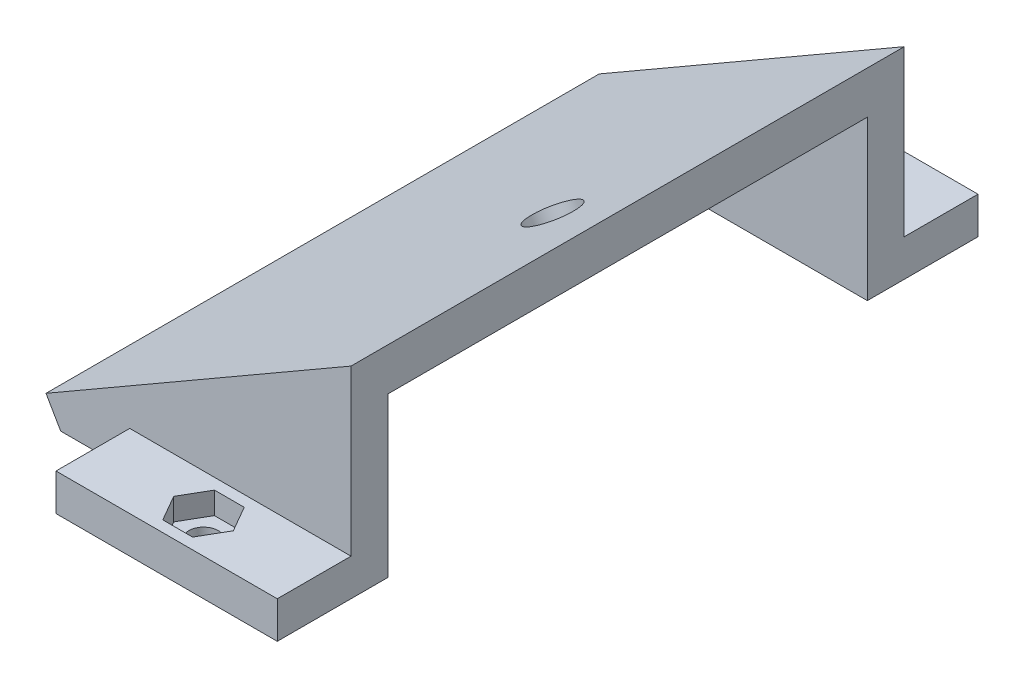
ISO-10303-21;
HEADER;
FILE_DESCRIPTION(('STEP AP214'),'2;1');
FILE_NAME('part.step','',(''),(''),'','','');
FILE_SCHEMA(('AUTOMOTIVE_DESIGN { 1 0 10303 214 1 1 1 1 }'));
ENDSEC;
DATA;
#1=APPLICATION_CONTEXT('core data for automotive mechanical design processes');
#2=APPLICATION_PROTOCOL_DEFINITION('international standard','automotive_design',2000,#1);
#3=PRODUCT_CONTEXT('',#1,'mechanical');
#4=PRODUCT('Part','Part','',(#3));
#5=PRODUCT_RELATED_PRODUCT_CATEGORY('part','',(#4));
#6=PRODUCT_DEFINITION_FORMATION('','',#4);
#7=PRODUCT_DEFINITION_CONTEXT('part definition',#1,'design');
#8=PRODUCT_DEFINITION('design','',#6,#7);
#9=PRODUCT_DEFINITION_SHAPE('','',#8);
#10=(LENGTH_UNIT() NAMED_UNIT(*) SI_UNIT(.MILLI.,.METRE.));
#11=(NAMED_UNIT(*) PLANE_ANGLE_UNIT() SI_UNIT($,.RADIAN.));
#12=(NAMED_UNIT(*) SI_UNIT($,.STERADIAN.) SOLID_ANGLE_UNIT());
#13=UNCERTAINTY_MEASURE_WITH_UNIT(LENGTH_MEASURE(1.E-05),#10,'distance_accuracy_value','');
#14=(GEOMETRIC_REPRESENTATION_CONTEXT(3) GLOBAL_UNCERTAINTY_ASSIGNED_CONTEXT((#13)) GLOBAL_UNIT_ASSIGNED_CONTEXT((#10,
#11,#12)) REPRESENTATION_CONTEXT('',''));
#15=CARTESIAN_POINT('',(0.,0.,0.));
#16=DIRECTION('',(0.,0.,1.));
#17=DIRECTION('',(1.,0.,0.));
#18=AXIS2_PLACEMENT_3D('',#15,#16,#17);
#19=CARTESIAN_POINT('',(0.,5.,85.));
#20=DIRECTION('',(0.,-1.,0.));
#21=DIRECTION('',(0.,0.,-1.));
#22=AXIS2_PLACEMENT_3D('',#19,#20,#21);
#23=PLANE('',#22);
#24=DIRECTION('',(-1.,0.,0.));
#25=VECTOR('',#24,1.);
#26=CARTESIAN_POINT('',(0.,5.,75.));
#27=LINE('',#26,#25);
#28=CARTESIAN_POINT('',(30.,5.,75.));
#29=VERTEX_POINT('',#28);
#30=CARTESIAN_POINT('',(0.,5.,75.));
#31=VERTEX_POINT('',#30);
#32=EDGE_CURVE('E354',#29,#31,#27,.T.);
#33=ORIENTED_EDGE('',*,*,#32,.T.);
#34=DIRECTION('',(0.,0.,-1.));
#35=VECTOR('',#34,1.);
#36=CARTESIAN_POINT('',(0.,5.,85.));
#37=LINE('',#36,#35);
#38=CARTESIAN_POINT('',(0.,5.,85.));
#39=VERTEX_POINT('',#38);
#40=EDGE_CURVE('E365',#39,#31,#37,.T.);
#41=ORIENTED_EDGE('',*,*,#40,.F.);
#42=DIRECTION('',(-1.,0.,0.));
#43=VECTOR('',#42,1.);
#44=CARTESIAN_POINT('',(0.,5.,85.));
#45=LINE('',#44,#43);
#46=CARTESIAN_POINT('',(30.,5.,85.));
#47=VERTEX_POINT('',#46);
#48=EDGE_CURVE('E363',#47,#39,#45,.T.);
#49=ORIENTED_EDGE('',*,*,#48,.F.);
#50=DIRECTION('',(0.,0.,-1.));
#51=VECTOR('',#50,1.);
#52=CARTESIAN_POINT('',(30.,5.,85.));
#53=LINE('',#52,#51);
#54=EDGE_CURVE('E370',#47,#29,#53,.T.);
#55=ORIENTED_EDGE('',*,*,#54,.T.);
#56=EDGE_LOOP('',(#33,#41,#49,#55));
#57=FACE_BOUND('',#56,.T.);
#58=DIRECTION('',(-0.499999999999999,0.,0.866025403784439));
#59=VECTOR('',#58,1.);
#60=CARTESIAN_POINT('',(19.0414518843274,5.,80.));
#61=LINE('',#60,#59);
#62=CARTESIAN_POINT('',(19.0414518843274,5.,80.));
#63=VERTEX_POINT('',#62);
#64=CARTESIAN_POINT('',(17.0207259421637,5.,83.5));
#65=VERTEX_POINT('',#64);
#66=EDGE_CURVE('E54',#63,#65,#61,.T.);
#67=ORIENTED_EDGE('',*,*,#66,.T.);
#68=DIRECTION('',(-1.,0.,0.));
#69=VECTOR('',#68,1.);
#70=CARTESIAN_POINT('',(17.0207259421637,5.,83.5));
#71=LINE('',#70,#69);
#72=CARTESIAN_POINT('',(12.9792740578363,5.,83.5));
#73=VERTEX_POINT('',#72);
#74=EDGE_CURVE('E232',#65,#73,#71,.T.);
#75=ORIENTED_EDGE('',*,*,#74,.T.);
#76=DIRECTION('',(-0.5,0.,-0.866025403784439));
#77=VECTOR('',#76,1.);
#78=CARTESIAN_POINT('',(12.9792740578363,5.,83.5));
#79=LINE('',#78,#77);
#80=CARTESIAN_POINT('',(10.9585481156726,5.,80.));
#81=VERTEX_POINT('',#80);
#82=EDGE_CURVE('E235',#73,#81,#79,.T.);
#83=ORIENTED_EDGE('',*,*,#82,.T.);
#84=DIRECTION('',(0.5,0.,-0.866025403784438));
#85=VECTOR('',#84,1.);
#86=CARTESIAN_POINT('',(10.9585481156726,5.,80.));
#87=LINE('',#86,#85);
#88=CARTESIAN_POINT('',(12.9792740578363,5.,76.5));
#89=VERTEX_POINT('',#88);
#90=EDGE_CURVE('E250',#81,#89,#87,.T.);
#91=ORIENTED_EDGE('',*,*,#90,.T.);
#92=DIRECTION('',(1.,0.,0.));
#93=VECTOR('',#92,1.);
#94=CARTESIAN_POINT('',(12.9792740578363,5.,76.5));
#95=LINE('',#94,#93);
#96=CARTESIAN_POINT('',(17.0207259421637,5.,76.5));
#97=VERTEX_POINT('',#96);
#98=EDGE_CURVE('E247',#89,#97,#95,.T.);
#99=ORIENTED_EDGE('',*,*,#98,.T.);
#100=DIRECTION('',(0.499999999999999,0.,0.866025403784439));
#101=VECTOR('',#100,1.);
#102=CARTESIAN_POINT('',(17.0207259421637,5.,76.5));
#103=LINE('',#102,#101);
#104=EDGE_CURVE('E245',#97,#63,#103,.T.);
#105=ORIENTED_EDGE('',*,*,#104,.T.);
#106=EDGE_LOOP('',(#67,#75,#83,#91,#99,#105));
#107=FACE_BOUND('',#106,.T.);
#108=ADVANCED_FACE('F37',(#57,#107),#23,.F.);
#109=CARTESIAN_POINT('',(15.,0.,80.));
#110=DIRECTION('',(0.,1.,0.));
#111=DIRECTION('',(0.,0.,1.));
#112=AXIS2_PLACEMENT_3D('',#109,#110,#111);
#113=CYLINDRICAL_SURFACE('',#112,2.);
#114=CARTESIAN_POINT('',(15.,0.,80.));
#115=DIRECTION('',(0.,-1.,0.));
#116=DIRECTION('',(0.,0.,-1.));
#117=AXIS2_PLACEMENT_3D('',#114,#115,#116);
#118=CIRCLE('',#117,2.);
#119=CARTESIAN_POINT('',(15.,0.,78.));
#120=VERTEX_POINT('',#119);
#121=EDGE_CURVE('E264',#120,#120,#118,.T.);
#122=ORIENTED_EDGE('',*,*,#121,.T.);
#123=EDGE_LOOP('',(#122));
#124=FACE_BOUND('',#123,.T.);
#125=CARTESIAN_POINT('',(15.,2.,80.));
#126=DIRECTION('',(0.,1.,0.));
#127=DIRECTION('',(0.,0.,1.));
#128=AXIS2_PLACEMENT_3D('',#125,#126,#127);
#129=CIRCLE('',#128,2.);
#130=CARTESIAN_POINT('',(15.,2.,82.));
#131=VERTEX_POINT('',#130);
#132=EDGE_CURVE('E41',#131,#131,#129,.T.);
#133=ORIENTED_EDGE('',*,*,#132,.T.);
#134=EDGE_LOOP('',(#133));
#135=FACE_BOUND('',#134,.T.);
#136=ADVANCED_FACE('F431',(#124,#135),#113,.F.);
#137=CARTESIAN_POINT('',(15.,0.,-5.));
#138=DIRECTION('',(0.,1.,0.));
#139=DIRECTION('',(0.,0.,1.));
#140=AXIS2_PLACEMENT_3D('',#137,#138,#139);
#141=CYLINDRICAL_SURFACE('',#140,2.);
#142=CARTESIAN_POINT('',(15.,0.,-5.));
#143=DIRECTION('',(0.,1.,0.));
#144=DIRECTION('',(0.,0.,1.));
#145=AXIS2_PLACEMENT_3D('',#142,#143,#144);
#146=CIRCLE('',#145,2.);
#147=CARTESIAN_POINT('',(15.,0.,-3.));
#148=VERTEX_POINT('',#147);
#149=EDGE_CURVE('E314',#148,#148,#146,.T.);
#150=ORIENTED_EDGE('',*,*,#149,.F.);
#151=EDGE_LOOP('',(#150));
#152=FACE_BOUND('',#151,.T.);
#153=CARTESIAN_POINT('',(15.,2.,-5.));
#154=DIRECTION('',(0.,1.,0.));
#155=DIRECTION('',(0.,0.,1.));
#156=AXIS2_PLACEMENT_3D('',#153,#154,#155);
#157=CIRCLE('',#156,2.);
#158=CARTESIAN_POINT('',(15.,2.,-3.));
#159=VERTEX_POINT('',#158);
#160=EDGE_CURVE('E304',#159,#159,#157,.F.);
#161=ORIENTED_EDGE('',*,*,#160,.F.);
#162=EDGE_LOOP('',(#161));
#163=FACE_BOUND('',#162,.T.);
#164=ADVANCED_FACE('F429',(#152,#163),#141,.F.);
#165=CARTESIAN_POINT('',(0.,10.,75.));
#166=DIRECTION('',(1.,0.,0.));
#167=DIRECTION('',(0.,0.,-1.));
#168=AXIS2_PLACEMENT_3D('',#165,#166,#167);
#169=PLANE('',#168);
#170=DIRECTION('',(0.,-1.,0.));
#171=VECTOR('',#170,1.);
#172=CARTESIAN_POINT('',(0.,0.,0.));
#173=LINE('',#172,#171);
#174=CARTESIAN_POINT('',(0.,5.,0.));
#175=VERTEX_POINT('',#174);
#176=CARTESIAN_POINT('',(0.,0.,0.));
#177=VERTEX_POINT('',#176);
#178=EDGE_CURVE('E11',#175,#177,#173,.T.);
#179=ORIENTED_EDGE('',*,*,#178,.F.);
#180=DIRECTION('',(0.,0.,1.));
#181=VECTOR('',#180,1.);
#182=CARTESIAN_POINT('',(0.,5.,-10.));
#183=LINE('',#182,#181);
#184=CARTESIAN_POINT('',(0.,5.,-10.));
#185=VERTEX_POINT('',#184);
#186=EDGE_CURVE('E351',#185,#175,#183,.T.);
#187=ORIENTED_EDGE('',*,*,#186,.F.);
#188=DIRECTION('',(0.,-1.,0.));
#189=VECTOR('',#188,1.);
#190=CARTESIAN_POINT('',(0.,0.,-10.));
#191=LINE('',#190,#189);
#192=CARTESIAN_POINT('',(0.,0.,-10.));
#193=VERTEX_POINT('',#192);
#194=EDGE_CURVE('E335',#185,#193,#191,.T.);
#195=ORIENTED_EDGE('',*,*,#194,.T.);
#196=DIRECTION('',(0.,0.,-1.));
#197=VECTOR('',#196,1.);
#198=CARTESIAN_POINT('',(0.,0.,75.));
#199=LINE('',#198,#197);
#200=EDGE_CURVE('E422',#177,#193,#199,.T.);
#201=ORIENTED_EDGE('',*,*,#200,.F.);
#202=EDGE_LOOP('',(#179,#187,#195,#201));
#203=FACE_BOUND('',#202,.T.);
#204=ADVANCED_FACE('F39',(#203),#169,.F.);
#205=DIRECTION('',(0.,1.,0.));
#206=VECTOR('',#205,1.);
#207=CARTESIAN_POINT('',(0.,0.,75.));
#208=LINE('',#207,#206);
#209=CARTESIAN_POINT('',(0.,0.,75.));
#210=VERTEX_POINT('',#209);
#211=EDGE_CURVE('E317',#210,#31,#208,.T.);
#212=ORIENTED_EDGE('',*,*,#211,.F.);
#213=CARTESIAN_POINT('',(0.,0.,85.));
#214=VERTEX_POINT('',#213);
#215=EDGE_CURVE('E46',#214,#210,#199,.T.);
#216=ORIENTED_EDGE('',*,*,#215,.F.);
#217=DIRECTION('',(0.,-1.,0.));
#218=VECTOR('',#217,1.);
#219=CARTESIAN_POINT('',(0.,0.,85.));
#220=LINE('',#219,#218);
#221=EDGE_CURVE('E355',#39,#214,#220,.T.);
#222=ORIENTED_EDGE('',*,*,#221,.F.);
#223=ORIENTED_EDGE('',*,*,#40,.T.);
#224=EDGE_LOOP('',(#212,#216,#222,#223));
#225=FACE_BOUND('',#224,.T.);
#226=ADVANCED_FACE('F438',(#225),#169,.F.);
#227=CARTESIAN_POINT('',(30.,0.,75.));
#228=DIRECTION('',(-1.,0.,0.));
#229=DIRECTION('',(0.,0.,1.));
#230=AXIS2_PLACEMENT_3D('',#227,#228,#229);
#231=PLANE('',#230);
#232=DIRECTION('',(0.,0.,-1.));
#233=VECTOR('',#232,1.);
#234=CARTESIAN_POINT('',(30.,0.,75.));
#235=LINE('',#234,#233);
#236=CARTESIAN_POINT('',(30.,0.,85.));
#237=VERTEX_POINT('',#236);
#238=CARTESIAN_POINT('',(30.,0.,70.));
#239=VERTEX_POINT('',#238);
#240=EDGE_CURVE('E419',#237,#239,#235,.T.);
#241=ORIENTED_EDGE('',*,*,#240,.T.);
#242=DIRECTION('',(0.,1.,0.));
#243=VECTOR('',#242,1.);
#244=CARTESIAN_POINT('',(30.,0.,70.));
#245=LINE('',#244,#243);
#246=CARTESIAN_POINT('',(30.,21.5470053837923,70.));
#247=VERTEX_POINT('',#246);
#248=EDGE_CURVE('E393',#239,#247,#245,.T.);
#249=ORIENTED_EDGE('',*,*,#248,.T.);
#250=DIRECTION('',(0.,0.,-1.));
#251=VECTOR('',#250,1.);
#252=CARTESIAN_POINT('',(30.,21.5470053837923,75.));
#253=LINE('',#252,#251);
#254=CARTESIAN_POINT('',(30.,21.5470053837923,5.));
#255=VERTEX_POINT('',#254);
#256=EDGE_CURVE('E398',#247,#255,#253,.T.);
#257=ORIENTED_EDGE('',*,*,#256,.T.);
#258=DIRECTION('',(0.,1.,0.));
#259=VECTOR('',#258,1.);
#260=CARTESIAN_POINT('',(30.,0.,5.));
#261=LINE('',#260,#259);
#262=CARTESIAN_POINT('',(30.,0.,5.));
#263=VERTEX_POINT('',#262);
#264=EDGE_CURVE('E390',#263,#255,#261,.T.);
#265=ORIENTED_EDGE('',*,*,#264,.F.);
#266=CARTESIAN_POINT('',(30.,0.,-10.));
#267=VERTEX_POINT('',#266);
#268=EDGE_CURVE('E418',#263,#267,#235,.T.);
#269=ORIENTED_EDGE('',*,*,#268,.T.);
#270=DIRECTION('',(0.,1.,0.));
#271=VECTOR('',#270,1.);
#272=CARTESIAN_POINT('',(30.,0.,-10.));
#273=LINE('',#272,#271);
#274=CARTESIAN_POINT('',(30.,5.,-10.));
#275=VERTEX_POINT('',#274);
#276=EDGE_CURVE('E341',#267,#275,#273,.T.);
#277=ORIENTED_EDGE('',*,*,#276,.T.);
#278=DIRECTION('',(0.,0.,1.));
#279=VECTOR('',#278,1.);
#280=CARTESIAN_POINT('',(30.,5.,-10.));
#281=LINE('',#280,#279);
#282=CARTESIAN_POINT('',(30.,5.,0.));
#283=VERTEX_POINT('',#282);
#284=EDGE_CURVE('E347',#275,#283,#281,.T.);
#285=ORIENTED_EDGE('',*,*,#284,.T.);
#286=DIRECTION('',(0.,1.,0.));
#287=VECTOR('',#286,1.);
#288=CARTESIAN_POINT('',(30.,0.,0.));
#289=LINE('',#288,#287);
#290=CARTESIAN_POINT('',(30.,27.3205080756885,0.));
#291=VERTEX_POINT('',#290);
#292=EDGE_CURVE('E405',#283,#291,#289,.T.);
#293=ORIENTED_EDGE('',*,*,#292,.T.);
#294=DIRECTION('',(0.,0.,-1.));
#295=VECTOR('',#294,1.);
#296=CARTESIAN_POINT('',(30.,27.3205080756885,75.));
#297=LINE('',#296,#295);
#298=CARTESIAN_POINT('',(30.,27.3205080756885,75.));
#299=VERTEX_POINT('',#298);
#300=EDGE_CURVE('E413',#299,#291,#297,.T.);
#301=ORIENTED_EDGE('',*,*,#300,.F.);
#302=DIRECTION('',(0.,1.,0.));
#303=VECTOR('',#302,1.);
#304=CARTESIAN_POINT('',(30.,0.,75.));
#305=LINE('',#304,#303);
#306=EDGE_CURVE('E408',#29,#299,#305,.T.);
#307=ORIENTED_EDGE('',*,*,#306,.F.);
#308=ORIENTED_EDGE('',*,*,#54,.F.);
#309=DIRECTION('',(0.,1.,0.));
#310=VECTOR('',#309,1.);
#311=CARTESIAN_POINT('',(30.,0.,85.));
#312=LINE('',#311,#310);
#313=EDGE_CURVE('E361',#237,#47,#312,.T.);
#314=ORIENTED_EDGE('',*,*,#313,.F.);
#315=EDGE_LOOP('',(#241,#249,#257,#265,#269,#277,#285,#293,#301,#307,#308,#314));
#316=FACE_BOUND('',#315,.T.);
#317=ADVANCED_FACE('F488',(#316),#231,.F.);
#318=CARTESIAN_POINT('',(0.,0.,75.));
#319=DIRECTION('',(0.,1.,0.));
#320=DIRECTION('',(0.,0.,1.));
#321=AXIS2_PLACEMENT_3D('',#318,#319,#320);
#322=PLANE('',#321);
#323=ORIENTED_EDGE('',*,*,#121,.F.);
#324=EDGE_LOOP('',(#323));
#325=FACE_BOUND('',#324,.T.);
#326=ORIENTED_EDGE('',*,*,#149,.T.);
#327=EDGE_LOOP('',(#326));
#328=FACE_BOUND('',#327,.T.);
#329=DIRECTION('',(0.,0.,1.));
#330=VECTOR('',#329,1.);
#331=CARTESIAN_POINT('',(5.,0.,70.));
#332=LINE('',#331,#330);
#333=CARTESIAN_POINT('',(5.,0.,5.));
#334=VERTEX_POINT('',#333);
#335=CARTESIAN_POINT('',(5.,0.,70.));
#336=VERTEX_POINT('',#335);
#337=EDGE_CURVE('E383',#334,#336,#332,.T.);
#338=ORIENTED_EDGE('',*,*,#337,.T.);
#339=DIRECTION('',(1.,0.,0.));
#340=VECTOR('',#339,1.);
#341=CARTESIAN_POINT('',(-60.1920240520265,0.,70.));
#342=LINE('',#341,#340);
#343=EDGE_CURVE('E379',#336,#239,#342,.T.);
#344=ORIENTED_EDGE('',*,*,#343,.T.);
#345=ORIENTED_EDGE('',*,*,#240,.F.);
#346=DIRECTION('',(1.,0.,0.));
#347=VECTOR('',#346,1.);
#348=CARTESIAN_POINT('',(0.,0.,85.));
#349=LINE('',#348,#347);
#350=EDGE_CURVE('E358',#214,#237,#349,.T.);
#351=ORIENTED_EDGE('',*,*,#350,.F.);
#352=ORIENTED_EDGE('',*,*,#215,.T.);
#353=DIRECTION('',(1.,0.,0.));
#354=VECTOR('',#353,1.);
#355=CARTESIAN_POINT('',(-9.36462136625573,0.,75.));
#356=LINE('',#355,#354);
#357=CARTESIAN_POINT('',(-9.36462136625573,0.,75.));
#358=VERTEX_POINT('',#357);
#359=EDGE_CURVE('E329',#358,#210,#356,.T.);
#360=ORIENTED_EDGE('',*,*,#359,.F.);
#361=DIRECTION('',(0.,0.,1.));
#362=VECTOR('',#361,1.);
#363=CARTESIAN_POINT('',(-9.36462136625573,0.,-15.1295761672295));
#364=LINE('',#363,#362);
#365=CARTESIAN_POINT('',(-9.36462136625573,0.,0.));
#366=VERTEX_POINT('',#365);
#367=EDGE_CURVE('E322',#366,#358,#364,.T.);
#368=ORIENTED_EDGE('',*,*,#367,.F.);
#369=DIRECTION('',(-1.,0.,0.));
#370=VECTOR('',#369,1.);
#371=CARTESIAN_POINT('',(-9.36462136625573,0.,0.));
#372=LINE('',#371,#370);
#373=EDGE_CURVE('E321',#177,#366,#372,.T.);
#374=ORIENTED_EDGE('',*,*,#373,.F.);
#375=ORIENTED_EDGE('',*,*,#200,.T.);
#376=DIRECTION('',(1.,0.,0.));
#377=VECTOR('',#376,1.);
#378=CARTESIAN_POINT('',(0.,0.,-10.));
#379=LINE('',#378,#377);
#380=EDGE_CURVE('E344',#193,#267,#379,.T.);
#381=ORIENTED_EDGE('',*,*,#380,.T.);
#382=ORIENTED_EDGE('',*,*,#268,.F.);
#383=DIRECTION('',(1.,0.,0.));
#384=VECTOR('',#383,1.);
#385=CARTESIAN_POINT('',(-60.1920240520265,0.,5.));
#386=LINE('',#385,#384);
#387=EDGE_CURVE('E380',#334,#263,#386,.T.);
#388=ORIENTED_EDGE('',*,*,#387,.F.);
#389=EDGE_LOOP('',(#338,#344,#345,#351,#352,#360,#368,#374,#375,#381,#382,#388));
#390=FACE_BOUND('',#389,.T.);
#391=ADVANCED_FACE('F486',(#325,#328,#390),#322,.F.);
#392=CARTESIAN_POINT('',(30.,27.3205080756885,75.));
#393=DIRECTION('',(0.499999999999995,-0.866025403784442,0.));
#394=DIRECTION('',(0.866025403784442,0.499999999999995,0.));
#395=AXIS2_PLACEMENT_3D('',#392,#393,#394);
#396=PLANE('',#395);
#397=CARTESIAN_POINT('',(19.8205080756889,21.443375672974,37.5));
#398=DIRECTION('',(0.499999999999995,-0.866025403784442,0.));
#399=DIRECTION('',(0.866025403784442,0.499999999999995,0.));
#400=AXIS2_PLACEMENT_3D('',#397,#398,#399);
#401=CIRCLE('',#400,3.25);
#402=CARTESIAN_POINT('',(22.6350906379883,23.0683756729739,37.5));
#403=VERTEX_POINT('',#402);
#404=EDGE_CURVE('E376',#403,#403,#401,.T.);
#405=ORIENTED_EDGE('',*,*,#404,.T.);
#406=EDGE_LOOP('',(#405));
#407=FACE_BOUND('',#406,.T.);
#408=DIRECTION('',(-0.866025403784442,-0.499999999999995,0.));
#409=VECTOR('',#408,1.);
#410=CARTESIAN_POINT('',(30.,27.3205080756885,0.));
#411=LINE('',#410,#409);
#412=CARTESIAN_POINT('',(-11.3535930436139,3.44499999999982,0.));
#413=VERTEX_POINT('',#412);
#414=EDGE_CURVE('E411',#291,#413,#411,.T.);
#415=ORIENTED_EDGE('',*,*,#414,.T.);
#416=DIRECTION('',(0.,0.,1.));
#417=VECTOR('',#416,1.);
#418=CARTESIAN_POINT('',(-11.3535930436139,3.44499999999982,-15.1295761672295));
#419=LINE('',#418,#417);
#420=CARTESIAN_POINT('',(-11.3535930436139,3.44499999999982,75.));
#421=VERTEX_POINT('',#420);
#422=EDGE_CURVE('E331',#413,#421,#419,.T.);
#423=ORIENTED_EDGE('',*,*,#422,.T.);
#424=DIRECTION('',(-0.866025403784442,-0.499999999999995,0.));
#425=VECTOR('',#424,1.);
#426=CARTESIAN_POINT('',(30.,27.3205080756885,75.));
#427=LINE('',#426,#425);
#428=EDGE_CURVE('E410',#299,#421,#427,.T.);
#429=ORIENTED_EDGE('',*,*,#428,.F.);
#430=ORIENTED_EDGE('',*,*,#300,.T.);
#431=EDGE_LOOP('',(#415,#423,#429,#430));
#432=FACE_BOUND('',#431,.T.);
#433=ADVANCED_FACE('F479',(#407,#432),#396,.F.);
#434=CARTESIAN_POINT('',(0.,0.,75.));
#435=DIRECTION('',(0.,0.,1.));
#436=DIRECTION('',(1.,0.,0.));
#437=AXIS2_PLACEMENT_3D('',#434,#435,#436);
#438=PLANE('',#437);
#439=ORIENTED_EDGE('',*,*,#32,.F.);
#440=ORIENTED_EDGE('',*,*,#306,.T.);
#441=ORIENTED_EDGE('',*,*,#428,.T.);
#442=DIRECTION('',(0.5,-0.866025403784438,0.));
#443=VECTOR('',#442,1.);
#444=CARTESIAN_POINT('',(-11.3535930436139,3.44499999999982,75.));
#445=LINE('',#444,#443);
#446=EDGE_CURVE('E326',#421,#358,#445,.T.);
#447=ORIENTED_EDGE('',*,*,#446,.T.);
#448=ORIENTED_EDGE('',*,*,#359,.T.);
#449=ORIENTED_EDGE('',*,*,#211,.T.);
#450=EDGE_LOOP('',(#439,#440,#441,#447,#448,#449));
#451=FACE_BOUND('',#450,.T.);
#452=ADVANCED_FACE('F476',(#451),#438,.T.);
#453=CARTESIAN_POINT('',(0.,0.,0.));
#454=DIRECTION('',(0.,0.,1.));
#455=DIRECTION('',(1.,0.,0.));
#456=AXIS2_PLACEMENT_3D('',#453,#454,#455);
#457=PLANE('',#456);
#458=ORIENTED_EDGE('',*,*,#292,.F.);
#459=DIRECTION('',(-1.,0.,0.));
#460=VECTOR('',#459,1.);
#461=CARTESIAN_POINT('',(0.,5.,0.));
#462=LINE('',#461,#460);
#463=EDGE_CURVE('E323',#283,#175,#462,.T.);
#464=ORIENTED_EDGE('',*,*,#463,.T.);
#465=ORIENTED_EDGE('',*,*,#178,.T.);
#466=ORIENTED_EDGE('',*,*,#373,.T.);
#467=DIRECTION('',(-0.5,0.866025403784439,0.));
#468=VECTOR('',#467,1.);
#469=CARTESIAN_POINT('',(-11.3535930436139,3.44499999999982,0.));
#470=LINE('',#469,#468);
#471=EDGE_CURVE('E318',#366,#413,#470,.T.);
#472=ORIENTED_EDGE('',*,*,#471,.T.);
#473=ORIENTED_EDGE('',*,*,#414,.F.);
#474=EDGE_LOOP('',(#458,#464,#465,#466,#472,#473));
#475=FACE_BOUND('',#474,.T.);
#476=ADVANCED_FACE('F464',(#475),#457,.F.);
#477=CARTESIAN_POINT('',(5.,10.,75.));
#478=DIRECTION('',(1.,0.,0.));
#479=DIRECTION('',(0.,0.,-1.));
#480=AXIS2_PLACEMENT_3D('',#477,#478,#479);
#481=PLANE('',#480);
#482=DIRECTION('',(0.,-1.,0.));
#483=VECTOR('',#482,1.);
#484=CARTESIAN_POINT('',(5.,10.,5.));
#485=LINE('',#484,#483);
#486=CARTESIAN_POINT('',(5.,7.11324865405186,5.));
#487=VERTEX_POINT('',#486);
#488=EDGE_CURVE('E388',#487,#334,#485,.T.);
#489=ORIENTED_EDGE('',*,*,#488,.F.);
#490=DIRECTION('',(0.,0.,-1.));
#491=VECTOR('',#490,1.);
#492=CARTESIAN_POINT('',(5.,7.11324865405186,75.));
#493=LINE('',#492,#491);
#494=CARTESIAN_POINT('',(5.,7.11324865405186,70.));
#495=VERTEX_POINT('',#494);
#496=EDGE_CURVE('E395',#495,#487,#493,.T.);
#497=ORIENTED_EDGE('',*,*,#496,.F.);
#498=DIRECTION('',(0.,-1.,0.));
#499=VECTOR('',#498,1.);
#500=CARTESIAN_POINT('',(5.,10.,70.));
#501=LINE('',#500,#499);
#502=EDGE_CURVE('E391',#495,#336,#501,.T.);
#503=ORIENTED_EDGE('',*,*,#502,.T.);
#504=ORIENTED_EDGE('',*,*,#337,.F.);
#505=EDGE_LOOP('',(#489,#497,#503,#504));
#506=FACE_BOUND('',#505,.T.);
#507=ADVANCED_FACE('F460',(#506),#481,.T.);
#508=CARTESIAN_POINT('',(32.5,22.9903810567663,75.));
#509=DIRECTION('',(0.499999999999995,-0.866025403784442,0.));
#510=DIRECTION('',(0.866025403784442,0.499999999999995,0.));
#511=AXIS2_PLACEMENT_3D('',#508,#509,#510);
#512=PLANE('',#511);
#513=CARTESIAN_POINT('',(22.3205080756888,17.1132486540518,37.5));
#514=DIRECTION('',(0.499999999999995,-0.866025403784442,0.));
#515=DIRECTION('',(0.866025403784442,0.499999999999995,0.));
#516=AXIS2_PLACEMENT_3D('',#513,#514,#515);
#517=CIRCLE('',#516,3.25);
#518=CARTESIAN_POINT('',(25.1350906379883,18.7382486540517,37.5));
#519=VERTEX_POINT('',#518);
#520=EDGE_CURVE('E373',#519,#519,#517,.T.);
#521=ORIENTED_EDGE('',*,*,#520,.F.);
#522=EDGE_LOOP('',(#521));
#523=FACE_BOUND('',#522,.T.);
#524=DIRECTION('',(-0.866025403784442,-0.499999999999995,0.));
#525=VECTOR('',#524,1.);
#526=CARTESIAN_POINT('',(32.5,22.9903810567663,5.));
#527=LINE('',#526,#525);
#528=EDGE_CURVE('E394',#255,#487,#527,.T.);
#529=ORIENTED_EDGE('',*,*,#528,.F.);
#530=ORIENTED_EDGE('',*,*,#256,.F.);
#531=DIRECTION('',(-0.866025403784442,-0.499999999999995,0.));
#532=VECTOR('',#531,1.);
#533=CARTESIAN_POINT('',(32.5,22.9903810567663,70.));
#534=LINE('',#533,#532);
#535=EDGE_CURVE('E399',#247,#495,#534,.T.);
#536=ORIENTED_EDGE('',*,*,#535,.T.);
#537=ORIENTED_EDGE('',*,*,#496,.T.);
#538=EDGE_LOOP('',(#529,#530,#536,#537));
#539=FACE_BOUND('',#538,.T.);
#540=ADVANCED_FACE('F463',(#523,#539),#512,.T.);
#541=CARTESIAN_POINT('',(0.,0.,70.));
#542=DIRECTION('',(0.,0.,1.));
#543=DIRECTION('',(1.,0.,0.));
#544=AXIS2_PLACEMENT_3D('',#541,#542,#543);
#545=PLANE('',#544);
#546=ORIENTED_EDGE('',*,*,#502,.F.);
#547=ORIENTED_EDGE('',*,*,#535,.F.);
#548=ORIENTED_EDGE('',*,*,#248,.F.);
#549=ORIENTED_EDGE('',*,*,#343,.F.);
#550=EDGE_LOOP('',(#546,#547,#548,#549));
#551=FACE_BOUND('',#550,.T.);
#552=ADVANCED_FACE('F468',(#551),#545,.F.);
#553=CARTESIAN_POINT('',(0.,0.,5.));
#554=DIRECTION('',(0.,0.,1.));
#555=DIRECTION('',(1.,0.,0.));
#556=AXIS2_PLACEMENT_3D('',#553,#554,#555);
#557=PLANE('',#556);
#558=ORIENTED_EDGE('',*,*,#488,.T.);
#559=ORIENTED_EDGE('',*,*,#387,.T.);
#560=ORIENTED_EDGE('',*,*,#264,.T.);
#561=ORIENTED_EDGE('',*,*,#528,.T.);
#562=EDGE_LOOP('',(#558,#559,#560,#561));
#563=FACE_BOUND('',#562,.T.);
#564=ADVANCED_FACE('F458',(#563),#557,.T.);
#565=CARTESIAN_POINT('',(12.320508075689,34.4337567297405,37.5));
#566=DIRECTION('',(0.499999999999995,-0.866025403784442,0.));
#567=DIRECTION('',(0.866025403784442,0.499999999999995,0.));
#568=AXIS2_PLACEMENT_3D('',#565,#566,#567);
#569=CYLINDRICAL_SURFACE('',#568,3.25);
#570=ORIENTED_EDGE('',*,*,#520,.T.);
#571=EDGE_LOOP('',(#570));
#572=FACE_BOUND('',#571,.T.);
#573=ORIENTED_EDGE('',*,*,#404,.F.);
#574=EDGE_LOOP('',(#573));
#575=FACE_BOUND('',#574,.T.);
#576=ADVANCED_FACE('F455',(#572,#575),#569,.F.);
#577=CARTESIAN_POINT('',(0.,0.,85.));
#578=DIRECTION('',(0.,0.,-1.));
#579=DIRECTION('',(-1.,0.,0.));
#580=AXIS2_PLACEMENT_3D('',#577,#578,#579);
#581=PLANE('',#580);
#582=ORIENTED_EDGE('',*,*,#221,.T.);
#583=ORIENTED_EDGE('',*,*,#350,.T.);
#584=ORIENTED_EDGE('',*,*,#313,.T.);
#585=ORIENTED_EDGE('',*,*,#48,.T.);
#586=EDGE_LOOP('',(#582,#583,#584,#585));
#587=FACE_BOUND('',#586,.T.);
#588=ADVANCED_FACE('F453',(#587),#581,.F.);
#589=CARTESIAN_POINT('',(0.,5.,-10.));
#590=DIRECTION('',(0.,1.,0.));
#591=DIRECTION('',(0.,0.,1.));
#592=AXIS2_PLACEMENT_3D('',#589,#590,#591);
#593=PLANE('',#592);
#594=DIRECTION('',(-0.499999999999999,0.,-0.866025403784439));
#595=VECTOR('',#594,1.);
#596=CARTESIAN_POINT('',(19.0414518843274,5.,-5.));
#597=LINE('',#596,#595);
#598=CARTESIAN_POINT('',(19.0414518843274,5.,-5.));
#599=VERTEX_POINT('',#598);
#600=CARTESIAN_POINT('',(17.0207259421637,5.,-8.5));
#601=VERTEX_POINT('',#600);
#602=EDGE_CURVE('E62',#599,#601,#597,.T.);
#603=ORIENTED_EDGE('',*,*,#602,.F.);
#604=DIRECTION('',(0.499999999999999,0.,-0.866025403784439));
#605=VECTOR('',#604,1.);
#606=CARTESIAN_POINT('',(17.0207259421637,5.,-1.50000000000001));
#607=LINE('',#606,#605);
#608=CARTESIAN_POINT('',(17.0207259421637,5.,-1.50000000000001));
#609=VERTEX_POINT('',#608);
#610=EDGE_CURVE('E271',#609,#599,#607,.T.);
#611=ORIENTED_EDGE('',*,*,#610,.F.);
#612=DIRECTION('',(1.,0.,0.));
#613=VECTOR('',#612,1.);
#614=CARTESIAN_POINT('',(12.9792740578363,5.,-1.5));
#615=LINE('',#614,#613);
#616=CARTESIAN_POINT('',(12.9792740578363,5.,-1.5));
#617=VERTEX_POINT('',#616);
#618=EDGE_CURVE('E297',#617,#609,#615,.T.);
#619=ORIENTED_EDGE('',*,*,#618,.F.);
#620=DIRECTION('',(0.5,0.,0.866025403784438));
#621=VECTOR('',#620,1.);
#622=CARTESIAN_POINT('',(10.9585481156726,5.,-5.));
#623=LINE('',#622,#621);
#624=CARTESIAN_POINT('',(10.9585481156726,5.,-5.));
#625=VERTEX_POINT('',#624);
#626=EDGE_CURVE('E294',#625,#617,#623,.T.);
#627=ORIENTED_EDGE('',*,*,#626,.F.);
#628=DIRECTION('',(-0.5,0.,0.866025403784439));
#629=VECTOR('',#628,1.);
#630=CARTESIAN_POINT('',(12.9792740578363,5.,-8.5));
#631=LINE('',#630,#629);
#632=CARTESIAN_POINT('',(12.9792740578363,5.,-8.5));
#633=VERTEX_POINT('',#632);
#634=EDGE_CURVE('E291',#633,#625,#631,.T.);
#635=ORIENTED_EDGE('',*,*,#634,.F.);
#636=DIRECTION('',(-1.,0.,0.));
#637=VECTOR('',#636,1.);
#638=CARTESIAN_POINT('',(17.0207259421637,5.,-8.5));
#639=LINE('',#638,#637);
#640=EDGE_CURVE('E288',#601,#633,#639,.T.);
#641=ORIENTED_EDGE('',*,*,#640,.F.);
#642=EDGE_LOOP('',(#603,#611,#619,#627,#635,#641));
#643=FACE_BOUND('',#642,.T.);
#644=ORIENTED_EDGE('',*,*,#463,.F.);
#645=ORIENTED_EDGE('',*,*,#284,.F.);
#646=DIRECTION('',(-1.,0.,0.));
#647=VECTOR('',#646,1.);
#648=CARTESIAN_POINT('',(0.,5.,-10.));
#649=LINE('',#648,#647);
#650=EDGE_CURVE('E338',#275,#185,#649,.T.);
#651=ORIENTED_EDGE('',*,*,#650,.T.);
#652=ORIENTED_EDGE('',*,*,#186,.T.);
#653=EDGE_LOOP('',(#644,#645,#651,#652));
#654=FACE_BOUND('',#653,.T.);
#655=ADVANCED_FACE('F538',(#643,#654),#593,.T.);
#656=CARTESIAN_POINT('',(0.,0.,-10.));
#657=DIRECTION('',(0.,0.,1.));
#658=DIRECTION('',(-1.,0.,0.));
#659=AXIS2_PLACEMENT_3D('',#656,#657,#658);
#660=PLANE('',#659);
#661=ORIENTED_EDGE('',*,*,#194,.F.);
#662=ORIENTED_EDGE('',*,*,#650,.F.);
#663=ORIENTED_EDGE('',*,*,#276,.F.);
#664=ORIENTED_EDGE('',*,*,#380,.F.);
#665=EDGE_LOOP('',(#661,#662,#663,#664));
#666=FACE_BOUND('',#665,.T.);
#667=ADVANCED_FACE('F532',(#666),#660,.F.);
#668=CARTESIAN_POINT('',(-11.3535930436139,3.44499999999982,-15.1295761672295));
#669=DIRECTION('',(-0.866025403784438,-0.5,0.));
#670=DIRECTION('',(0.5,-0.866025403784439,0.));
#671=AXIS2_PLACEMENT_3D('',#668,#669,#670);
#672=PLANE('',#671);
#673=ORIENTED_EDGE('',*,*,#471,.F.);
#674=ORIENTED_EDGE('',*,*,#367,.T.);
#675=ORIENTED_EDGE('',*,*,#446,.F.);
#676=ORIENTED_EDGE('',*,*,#422,.F.);
#677=EDGE_LOOP('',(#673,#674,#675,#676));
#678=FACE_BOUND('',#677,.T.);
#679=ADVANCED_FACE('F523',(#678),#672,.T.);
#680=CARTESIAN_POINT('',(0.,2.,0.));
#681=DIRECTION('',(0.,1.,0.));
#682=DIRECTION('',(0.,0.,1.));
#683=AXIS2_PLACEMENT_3D('',#680,#681,#682);
#684=PLANE('',#683);
#685=DIRECTION('',(-0.499999999999999,0.,-0.866025403784439));
#686=VECTOR('',#685,1.);
#687=CARTESIAN_POINT('',(19.0414518843274,2.,-5.));
#688=LINE('',#687,#686);
#689=CARTESIAN_POINT('',(19.0414518843274,2.,-5.));
#690=VERTEX_POINT('',#689);
#691=CARTESIAN_POINT('',(17.0207259421637,2.,-8.5));
#692=VERTEX_POINT('',#691);
#693=EDGE_CURVE('E267',#690,#692,#688,.T.);
#694=ORIENTED_EDGE('',*,*,#693,.T.);
#695=DIRECTION('',(-1.,0.,0.));
#696=VECTOR('',#695,1.);
#697=CARTESIAN_POINT('',(17.0207259421637,2.,-8.5));
#698=LINE('',#697,#696);
#699=CARTESIAN_POINT('',(12.9792740578363,2.,-8.5));
#700=VERTEX_POINT('',#699);
#701=EDGE_CURVE('E270',#692,#700,#698,.T.);
#702=ORIENTED_EDGE('',*,*,#701,.T.);
#703=DIRECTION('',(-0.5,0.,0.866025403784439));
#704=VECTOR('',#703,1.);
#705=CARTESIAN_POINT('',(12.9792740578363,2.,-8.5));
#706=LINE('',#705,#704);
#707=CARTESIAN_POINT('',(10.9585481156726,2.,-5.));
#708=VERTEX_POINT('',#707);
#709=EDGE_CURVE('E274',#700,#708,#706,.T.);
#710=ORIENTED_EDGE('',*,*,#709,.T.);
#711=DIRECTION('',(0.5,0.,0.866025403784438));
#712=VECTOR('',#711,1.);
#713=CARTESIAN_POINT('',(10.9585481156726,2.,-5.));
#714=LINE('',#713,#712);
#715=CARTESIAN_POINT('',(12.9792740578363,2.,-1.5));
#716=VERTEX_POINT('',#715);
#717=EDGE_CURVE('E277',#708,#716,#714,.T.);
#718=ORIENTED_EDGE('',*,*,#717,.T.);
#719=DIRECTION('',(1.,0.,0.));
#720=VECTOR('',#719,1.);
#721=CARTESIAN_POINT('',(12.9792740578363,2.,-1.5));
#722=LINE('',#721,#720);
#723=CARTESIAN_POINT('',(17.0207259421637,2.,-1.50000000000001));
#724=VERTEX_POINT('',#723);
#725=EDGE_CURVE('E280',#716,#724,#722,.T.);
#726=ORIENTED_EDGE('',*,*,#725,.T.);
#727=DIRECTION('',(0.499999999999999,0.,-0.866025403784439));
#728=VECTOR('',#727,1.);
#729=CARTESIAN_POINT('',(17.0207259421637,2.,-1.50000000000001));
#730=LINE('',#729,#728);
#731=EDGE_CURVE('E283',#724,#690,#730,.T.);
#732=ORIENTED_EDGE('',*,*,#731,.T.);
#733=EDGE_LOOP('',(#694,#702,#710,#718,#726,#732));
#734=FACE_BOUND('',#733,.T.);
#735=ORIENTED_EDGE('',*,*,#160,.T.);
#736=EDGE_LOOP('',(#735));
#737=FACE_BOUND('',#736,.T.);
#738=ADVANCED_FACE('F427',(#734,#737),#684,.T.);
#739=CARTESIAN_POINT('',(19.0414518843274,2.,-5.));
#740=DIRECTION('',(0.866025403784439,0.,-0.499999999999999));
#741=DIRECTION('',(-0.499999999999999,0.,-0.866025403784439));
#742=AXIS2_PLACEMENT_3D('',#739,#740,#741);
#743=PLANE('',#742);
#744=ORIENTED_EDGE('',*,*,#602,.T.);
#745=DIRECTION('',(0.,1.,0.));
#746=VECTOR('',#745,1.);
#747=CARTESIAN_POINT('',(17.0207259421637,2.,-8.5));
#748=LINE('',#747,#746);
#749=EDGE_CURVE('E286',#692,#601,#748,.T.);
#750=ORIENTED_EDGE('',*,*,#749,.F.);
#751=ORIENTED_EDGE('',*,*,#693,.F.);
#752=DIRECTION('',(0.,1.,0.));
#753=VECTOR('',#752,1.);
#754=CARTESIAN_POINT('',(19.0414518843274,2.,-5.));
#755=LINE('',#754,#753);
#756=EDGE_CURVE('E302',#690,#599,#755,.T.);
#757=ORIENTED_EDGE('',*,*,#756,.T.);
#758=EDGE_LOOP('',(#744,#750,#751,#757));
#759=FACE_BOUND('',#758,.T.);
#760=ADVANCED_FACE('F550',(#759),#743,.F.);
#761=CARTESIAN_POINT('',(17.0207259421637,2.,-1.50000000000001));
#762=DIRECTION('',(0.866025403784439,0.,0.499999999999999));
#763=DIRECTION('',(0.499999999999999,0.,-0.866025403784439));
#764=AXIS2_PLACEMENT_3D('',#761,#762,#763);
#765=PLANE('',#764);
#766=ORIENTED_EDGE('',*,*,#610,.T.);
#767=ORIENTED_EDGE('',*,*,#756,.F.);
#768=ORIENTED_EDGE('',*,*,#731,.F.);
#769=DIRECTION('',(0.,1.,0.));
#770=VECTOR('',#769,1.);
#771=CARTESIAN_POINT('',(17.0207259421637,2.,-1.50000000000001));
#772=LINE('',#771,#770);
#773=EDGE_CURVE('E305',#724,#609,#772,.T.);
#774=ORIENTED_EDGE('',*,*,#773,.T.);
#775=EDGE_LOOP('',(#766,#767,#768,#774));
#776=FACE_BOUND('',#775,.T.);
#777=ADVANCED_FACE('F556',(#776),#765,.F.);
#778=CARTESIAN_POINT('',(12.9792740578363,2.,-1.5));
#779=DIRECTION('',(0.,0.,1.));
#780=DIRECTION('',(1.,0.,0.));
#781=AXIS2_PLACEMENT_3D('',#778,#779,#780);
#782=PLANE('',#781);
#783=ORIENTED_EDGE('',*,*,#618,.T.);
#784=ORIENTED_EDGE('',*,*,#773,.F.);
#785=ORIENTED_EDGE('',*,*,#725,.F.);
#786=DIRECTION('',(0.,1.,0.));
#787=VECTOR('',#786,1.);
#788=CARTESIAN_POINT('',(12.9792740578363,2.,-1.5));
#789=LINE('',#788,#787);
#790=EDGE_CURVE('E307',#716,#617,#789,.T.);
#791=ORIENTED_EDGE('',*,*,#790,.T.);
#792=EDGE_LOOP('',(#783,#784,#785,#791));
#793=FACE_BOUND('',#792,.T.);
#794=ADVANCED_FACE('F561',(#793),#782,.F.);
#795=CARTESIAN_POINT('',(10.9585481156726,2.,-5.));
#796=DIRECTION('',(-0.866025403784439,0.,0.5));
#797=DIRECTION('',(0.5,0.,0.866025403784439));
#798=AXIS2_PLACEMENT_3D('',#795,#796,#797);
#799=PLANE('',#798);
#800=ORIENTED_EDGE('',*,*,#626,.T.);
#801=ORIENTED_EDGE('',*,*,#790,.F.);
#802=ORIENTED_EDGE('',*,*,#717,.F.);
#803=DIRECTION('',(0.,1.,0.));
#804=VECTOR('',#803,1.);
#805=CARTESIAN_POINT('',(10.9585481156726,2.,-5.));
#806=LINE('',#805,#804);
#807=EDGE_CURVE('E309',#708,#625,#806,.T.);
#808=ORIENTED_EDGE('',*,*,#807,.T.);
#809=EDGE_LOOP('',(#800,#801,#802,#808));
#810=FACE_BOUND('',#809,.T.);
#811=ADVANCED_FACE('F565',(#810),#799,.F.);
#812=CARTESIAN_POINT('',(12.9792740578363,2.,-8.5));
#813=DIRECTION('',(-0.866025403784439,0.,-0.5));
#814=DIRECTION('',(-0.5,0.,0.866025403784439));
#815=AXIS2_PLACEMENT_3D('',#812,#813,#814);
#816=PLANE('',#815);
#817=ORIENTED_EDGE('',*,*,#634,.T.);
#818=ORIENTED_EDGE('',*,*,#807,.F.);
#819=ORIENTED_EDGE('',*,*,#709,.F.);
#820=DIRECTION('',(0.,1.,0.));
#821=VECTOR('',#820,1.);
#822=CARTESIAN_POINT('',(12.9792740578363,2.,-8.5));
#823=LINE('',#822,#821);
#824=EDGE_CURVE('E311',#700,#633,#823,.T.);
#825=ORIENTED_EDGE('',*,*,#824,.T.);
#826=EDGE_LOOP('',(#817,#818,#819,#825));
#827=FACE_BOUND('',#826,.T.);
#828=ADVANCED_FACE('F569',(#827),#816,.F.);
#829=CARTESIAN_POINT('',(17.0207259421637,2.,-8.5));
#830=DIRECTION('',(0.,0.,-1.));
#831=DIRECTION('',(-1.,0.,0.));
#832=AXIS2_PLACEMENT_3D('',#829,#830,#831);
#833=PLANE('',#832);
#834=ORIENTED_EDGE('',*,*,#640,.T.);
#835=ORIENTED_EDGE('',*,*,#824,.F.);
#836=ORIENTED_EDGE('',*,*,#701,.F.);
#837=ORIENTED_EDGE('',*,*,#749,.T.);
#838=EDGE_LOOP('',(#834,#835,#836,#837));
#839=FACE_BOUND('',#838,.T.);
#840=ADVANCED_FACE('F573',(#839),#833,.F.);
#841=CARTESIAN_POINT('',(19.0414518843274,2.,80.));
#842=DIRECTION('',(-0.866025403784439,0.,-0.499999999999999));
#843=DIRECTION('',(-0.499999999999999,0.,0.866025403784439));
#844=AXIS2_PLACEMENT_3D('',#841,#842,#843);
#845=PLANE('',#844);
#846=ORIENTED_EDGE('',*,*,#66,.F.);
#847=DIRECTION('',(0.,1.,0.));
#848=VECTOR('',#847,1.);
#849=CARTESIAN_POINT('',(19.0414518843274,2.,80.));
#850=LINE('',#849,#848);
#851=CARTESIAN_POINT('',(19.0414518843274,2.,80.));
#852=VERTEX_POINT('',#851);
#853=EDGE_CURVE('E216',#852,#63,#850,.T.);
#854=ORIENTED_EDGE('',*,*,#853,.F.);
#855=DIRECTION('',(-0.499999999999999,0.,0.866025403784439));
#856=VECTOR('',#855,1.);
#857=CARTESIAN_POINT('',(19.0414518843274,2.,80.));
#858=LINE('',#857,#856);
#859=CARTESIAN_POINT('',(17.0207259421637,2.,83.5));
#860=VERTEX_POINT('',#859);
#861=EDGE_CURVE('E223',#852,#860,#858,.T.);
#862=ORIENTED_EDGE('',*,*,#861,.T.);
#863=DIRECTION('',(0.,1.,0.));
#864=VECTOR('',#863,1.);
#865=CARTESIAN_POINT('',(17.0207259421637,2.,83.5));
#866=LINE('',#865,#864);
#867=EDGE_CURVE('E255',#860,#65,#866,.T.);
#868=ORIENTED_EDGE('',*,*,#867,.T.);
#869=EDGE_LOOP('',(#846,#854,#862,#868));
#870=FACE_BOUND('',#869,.T.);
#871=ADVANCED_FACE('F226',(#870),#845,.T.);
#872=CARTESIAN_POINT('',(17.0207259421637,2.,83.5));
#873=DIRECTION('',(0.,0.,-1.));
#874=DIRECTION('',(-1.,0.,0.));
#875=AXIS2_PLACEMENT_3D('',#872,#873,#874);
#876=PLANE('',#875);
#877=ORIENTED_EDGE('',*,*,#74,.F.);
#878=ORIENTED_EDGE('',*,*,#867,.F.);
#879=DIRECTION('',(-1.,0.,0.));
#880=VECTOR('',#879,1.);
#881=CARTESIAN_POINT('',(17.0207259421637,2.,83.5));
#882=LINE('',#881,#880);
#883=CARTESIAN_POINT('',(12.9792740578363,2.,83.5));
#884=VERTEX_POINT('',#883);
#885=EDGE_CURVE('E228',#860,#884,#882,.T.);
#886=ORIENTED_EDGE('',*,*,#885,.T.);
#887=DIRECTION('',(0.,1.,0.));
#888=VECTOR('',#887,1.);
#889=CARTESIAN_POINT('',(12.9792740578363,2.,83.5));
#890=LINE('',#889,#888);
#891=EDGE_CURVE('E257',#884,#73,#890,.T.);
#892=ORIENTED_EDGE('',*,*,#891,.T.);
#893=EDGE_LOOP('',(#877,#878,#886,#892));
#894=FACE_BOUND('',#893,.T.);
#895=ADVANCED_FACE('F580',(#894),#876,.T.);
#896=CARTESIAN_POINT('',(12.9792740578363,2.,83.5));
#897=DIRECTION('',(0.866025403784439,0.,-0.5));
#898=DIRECTION('',(-0.5,0.,-0.866025403784439));
#899=AXIS2_PLACEMENT_3D('',#896,#897,#898);
#900=PLANE('',#899);
#901=ORIENTED_EDGE('',*,*,#82,.F.);
#902=ORIENTED_EDGE('',*,*,#891,.F.);
#903=DIRECTION('',(-0.5,0.,-0.866025403784439));
#904=VECTOR('',#903,1.);
#905=CARTESIAN_POINT('',(12.9792740578363,2.,83.5));
#906=LINE('',#905,#904);
#907=CARTESIAN_POINT('',(10.9585481156726,2.,80.));
#908=VERTEX_POINT('',#907);
#909=EDGE_CURVE('E241',#884,#908,#906,.T.);
#910=ORIENTED_EDGE('',*,*,#909,.T.);
#911=DIRECTION('',(0.,1.,0.));
#912=VECTOR('',#911,1.);
#913=CARTESIAN_POINT('',(10.9585481156726,2.,80.));
#914=LINE('',#913,#912);
#915=EDGE_CURVE('E259',#908,#81,#914,.T.);
#916=ORIENTED_EDGE('',*,*,#915,.T.);
#917=EDGE_LOOP('',(#901,#902,#910,#916));
#918=FACE_BOUND('',#917,.T.);
#919=ADVANCED_FACE('F595',(#918),#900,.T.);
#920=CARTESIAN_POINT('',(10.9585481156726,2.,80.));
#921=DIRECTION('',(0.866025403784439,0.,0.5));
#922=DIRECTION('',(0.5,0.,-0.866025403784439));
#923=AXIS2_PLACEMENT_3D('',#920,#921,#922);
#924=PLANE('',#923);
#925=ORIENTED_EDGE('',*,*,#90,.F.);
#926=ORIENTED_EDGE('',*,*,#915,.F.);
#927=DIRECTION('',(0.5,0.,-0.866025403784438));
#928=VECTOR('',#927,1.);
#929=CARTESIAN_POINT('',(10.9585481156726,2.,80.));
#930=LINE('',#929,#928);
#931=CARTESIAN_POINT('',(12.9792740578363,2.,76.5));
#932=VERTEX_POINT('',#931);
#933=EDGE_CURVE('E239',#908,#932,#930,.T.);
#934=ORIENTED_EDGE('',*,*,#933,.T.);
#935=DIRECTION('',(0.,1.,0.));
#936=VECTOR('',#935,1.);
#937=CARTESIAN_POINT('',(12.9792740578363,2.,76.5));
#938=LINE('',#937,#936);
#939=EDGE_CURVE('E261',#932,#89,#938,.T.);
#940=ORIENTED_EDGE('',*,*,#939,.T.);
#941=EDGE_LOOP('',(#925,#926,#934,#940));
#942=FACE_BOUND('',#941,.T.);
#943=ADVANCED_FACE('F604',(#942),#924,.T.);
#944=CARTESIAN_POINT('',(12.9792740578363,2.,76.5));
#945=DIRECTION('',(0.,0.,1.));
#946=DIRECTION('',(1.,0.,0.));
#947=AXIS2_PLACEMENT_3D('',#944,#945,#946);
#948=PLANE('',#947);
#949=ORIENTED_EDGE('',*,*,#98,.F.);
#950=ORIENTED_EDGE('',*,*,#939,.F.);
#951=DIRECTION('',(1.,0.,0.));
#952=VECTOR('',#951,1.);
#953=CARTESIAN_POINT('',(12.9792740578363,2.,76.5));
#954=LINE('',#953,#952);
#955=CARTESIAN_POINT('',(17.0207259421637,2.,76.5));
#956=VERTEX_POINT('',#955);
#957=EDGE_CURVE('E222',#932,#956,#954,.T.);
#958=ORIENTED_EDGE('',*,*,#957,.T.);
#959=DIRECTION('',(0.,1.,0.));
#960=VECTOR('',#959,1.);
#961=CARTESIAN_POINT('',(17.0207259421637,2.,76.5));
#962=LINE('',#961,#960);
#963=EDGE_CURVE('E218',#956,#97,#962,.T.);
#964=ORIENTED_EDGE('',*,*,#963,.T.);
#965=EDGE_LOOP('',(#949,#950,#958,#964));
#966=FACE_BOUND('',#965,.T.);
#967=ADVANCED_FACE('F601',(#966),#948,.T.);
#968=CARTESIAN_POINT('',(17.0207259421637,2.,76.5));
#969=DIRECTION('',(-0.866025403784439,0.,0.499999999999999));
#970=DIRECTION('',(0.499999999999999,0.,0.866025403784439));
#971=AXIS2_PLACEMENT_3D('',#968,#969,#970);
#972=PLANE('',#971);
#973=ORIENTED_EDGE('',*,*,#104,.F.);
#974=ORIENTED_EDGE('',*,*,#963,.F.);
#975=DIRECTION('',(0.499999999999999,0.,0.866025403784439));
#976=VECTOR('',#975,1.);
#977=CARTESIAN_POINT('',(17.0207259421637,2.,76.5));
#978=LINE('',#977,#976);
#979=EDGE_CURVE('E213',#956,#852,#978,.T.);
#980=ORIENTED_EDGE('',*,*,#979,.T.);
#981=ORIENTED_EDGE('',*,*,#853,.T.);
#982=EDGE_LOOP('',(#973,#974,#980,#981));
#983=FACE_BOUND('',#982,.T.);
#984=ADVANCED_FACE('F215',(#983),#972,.T.);
#985=CARTESIAN_POINT('',(0.,2.,75.));
#986=DIRECTION('',(0.,1.,0.));
#987=DIRECTION('',(0.,0.,-1.));
#988=AXIS2_PLACEMENT_3D('',#985,#986,#987);
#989=PLANE('',#988);
#990=ORIENTED_EDGE('',*,*,#132,.F.);
#991=EDGE_LOOP('',(#990));
#992=FACE_BOUND('',#991,.T.);
#993=ORIENTED_EDGE('',*,*,#861,.F.);
#994=ORIENTED_EDGE('',*,*,#979,.F.);
#995=ORIENTED_EDGE('',*,*,#957,.F.);
#996=ORIENTED_EDGE('',*,*,#933,.F.);
#997=ORIENTED_EDGE('',*,*,#909,.F.);
#998=ORIENTED_EDGE('',*,*,#885,.F.);
#999=EDGE_LOOP('',(#993,#994,#995,#996,#997,#998));
#1000=FACE_BOUND('',#999,.T.);
#1001=ADVANCED_FACE('F230',(#992,#1000),#989,.T.);
#1002=CLOSED_SHELL('',(#108,#136,#164,#204,#226,#317,#391,#433,#452,#476,#507,#540,#552,#564,
#576,#588,#655,#667,#679,#738,#760,#777,#794,#811,#828,#840,#871,#895,#919,#943,#967,#984,#1001));
#1003=MANIFOLD_SOLID_BREP('B2',#1002);
#1004=ADVANCED_BREP_SHAPE_REPRESENTATION('',(#18,#1003),#14);
#1005=SHAPE_DEFINITION_REPRESENTATION(#9,#1004);
ENDSEC;
END-ISO-10303-21;
